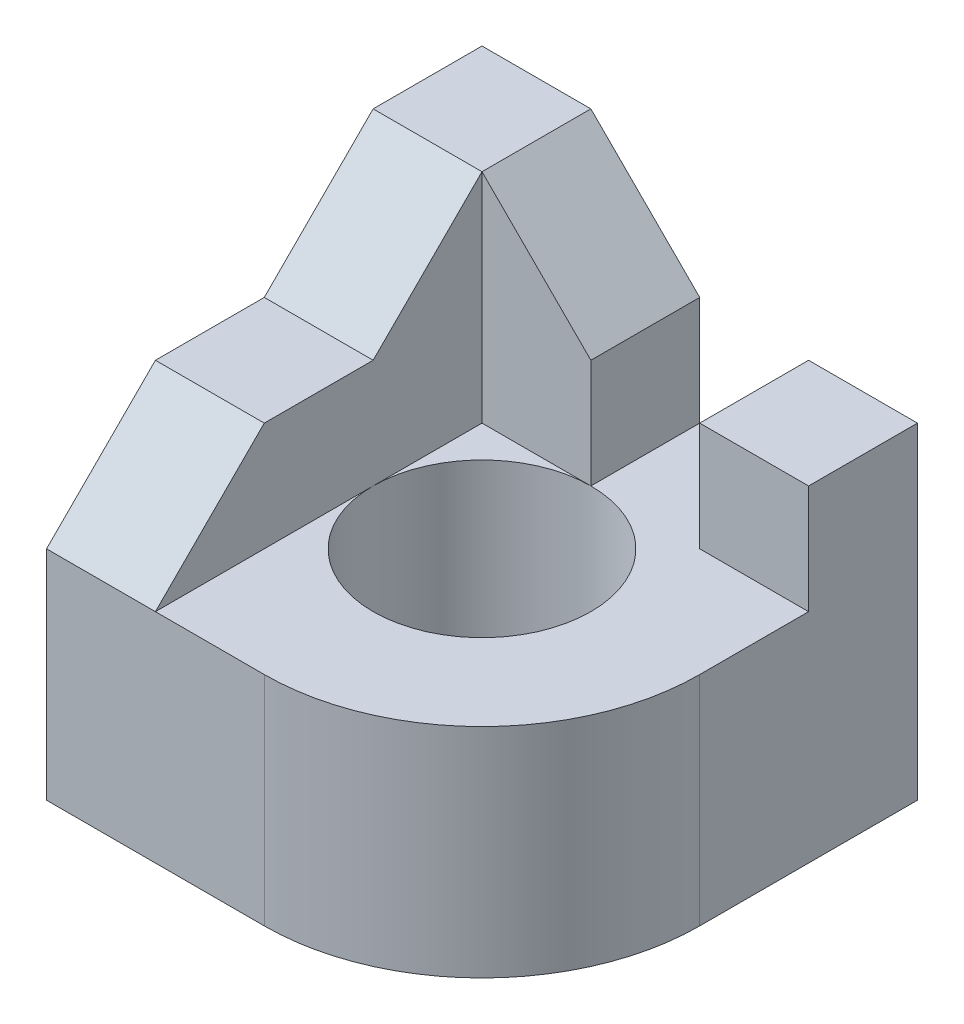
ISO-10303-21;
HEADER;
FILE_DESCRIPTION(('STEP AP214'),'2;1');
FILE_NAME('part.step','',(''),(''),'','','');
FILE_SCHEMA(('AUTOMOTIVE_DESIGN { 1 0 10303 214 1 1 1 1 }'));
ENDSEC;
DATA;
#1=APPLICATION_CONTEXT('core data for automotive mechanical design processes');
#2=APPLICATION_PROTOCOL_DEFINITION('international standard','automotive_design',2000,#1);
#3=PRODUCT_CONTEXT('',#1,'mechanical');
#4=PRODUCT('Part','Part','',(#3));
#5=PRODUCT_RELATED_PRODUCT_CATEGORY('part','',(#4));
#6=PRODUCT_DEFINITION_FORMATION('','',#4);
#7=PRODUCT_DEFINITION_CONTEXT('part definition',#1,'design');
#8=PRODUCT_DEFINITION('design','',#6,#7);
#9=PRODUCT_DEFINITION_SHAPE('','',#8);
#10=(LENGTH_UNIT() NAMED_UNIT(*) SI_UNIT(.MILLI.,.METRE.));
#11=(NAMED_UNIT(*) PLANE_ANGLE_UNIT() SI_UNIT($,.RADIAN.));
#12=(NAMED_UNIT(*) SI_UNIT($,.STERADIAN.) SOLID_ANGLE_UNIT());
#13=UNCERTAINTY_MEASURE_WITH_UNIT(LENGTH_MEASURE(1.E-05),#10,'distance_accuracy_value','');
#14=(GEOMETRIC_REPRESENTATION_CONTEXT(3) GLOBAL_UNCERTAINTY_ASSIGNED_CONTEXT((#13)) GLOBAL_UNIT_ASSIGNED_CONTEXT((#10,
#11,#12)) REPRESENTATION_CONTEXT('',''));
#15=CARTESIAN_POINT('',(0.,0.,0.));
#16=DIRECTION('',(0.,0.,1.));
#17=DIRECTION('',(1.,0.,0.));
#18=AXIS2_PLACEMENT_3D('',#15,#16,#17);
#19=CARTESIAN_POINT('',(0.,0.,0.));
#20=DIRECTION('',(0.,1.,0.));
#21=DIRECTION('',(0.,0.,1.));
#22=AXIS2_PLACEMENT_3D('',#19,#20,#21);
#23=CYLINDRICAL_SURFACE('',#22,10.);
#24=CARTESIAN_POINT('',(0.,0.,0.));
#25=DIRECTION('',(0.,1.,0.));
#26=DIRECTION('',(0.,0.,1.));
#27=AXIS2_PLACEMENT_3D('',#24,#25,#26);
#28=CIRCLE('',#27,10.);
#29=CARTESIAN_POINT('',(0.,0.,10.));
#30=VERTEX_POINT('',#29);
#31=EDGE_CURVE('E217',#30,#30,#28,.T.);
#32=ORIENTED_EDGE('',*,*,#31,.F.);
#33=EDGE_LOOP('',(#32));
#34=FACE_BOUND('',#33,.T.);
#35=CARTESIAN_POINT('',(0.,20.,0.));
#36=DIRECTION('',(0.,1.,0.));
#37=DIRECTION('',(0.,0.,1.));
#38=AXIS2_PLACEMENT_3D('',#35,#36,#37);
#39=CIRCLE('',#38,10.);
#40=CARTESIAN_POINT('',(0.,20.,-10.));
#41=VERTEX_POINT('',#40);
#42=CARTESIAN_POINT('',(-10.,20.,0.));
#43=VERTEX_POINT('',#42);
#44=EDGE_CURVE('E311',#41,#43,#39,.T.);
#45=ORIENTED_EDGE('',*,*,#44,.T.);
#46=CARTESIAN_POINT('',(0.,20.,0.));
#47=DIRECTION('',(0.,-1.,0.));
#48=DIRECTION('',(0.,0.,-1.));
#49=AXIS2_PLACEMENT_3D('',#46,#47,#48);
#50=CIRCLE('',#49,10.);
#51=EDGE_CURVE('E210',#43,#41,#50,.F.);
#52=ORIENTED_EDGE('',*,*,#51,.T.);
#53=EDGE_LOOP('',(#45,#52));
#54=FACE_BOUND('',#53,.T.);
#55=ADVANCED_FACE('F44',(#34,#54),#23,.F.);
#56=CARTESIAN_POINT('',(0.,30.,-20.));
#57=DIRECTION('',(-0.707106781186548,-0.707106781186547,0.));
#58=DIRECTION('',(0.707106781186547,-0.707106781186548,0.));
#59=AXIS2_PLACEMENT_3D('',#56,#57,#58);
#60=PLANE('',#59);
#61=DIRECTION('',(-0.707106781186547,0.707106781186548,0.));
#62=VECTOR('',#61,1.);
#63=CARTESIAN_POINT('',(0.,30.,-10.));
#64=LINE('',#63,#62);
#65=CARTESIAN_POINT('',(0.,30.,-10.));
#66=VERTEX_POINT('',#65);
#67=CARTESIAN_POINT('',(-10.,40.,-10.));
#68=VERTEX_POINT('',#67);
#69=EDGE_CURVE('E152',#66,#68,#64,.T.);
#70=ORIENTED_EDGE('',*,*,#69,.F.);
#71=DIRECTION('',(0.,0.,1.));
#72=VECTOR('',#71,1.);
#73=CARTESIAN_POINT('',(0.,30.,-20.));
#74=LINE('',#73,#72);
#75=CARTESIAN_POINT('',(0.,30.,-20.));
#76=VERTEX_POINT('',#75);
#77=EDGE_CURVE('E190',#76,#66,#74,.T.);
#78=ORIENTED_EDGE('',*,*,#77,.F.);
#79=DIRECTION('',(0.707106781186547,-0.707106781186548,0.));
#80=VECTOR('',#79,1.);
#81=CARTESIAN_POINT('',(0.,30.,-20.));
#82=LINE('',#81,#80);
#83=CARTESIAN_POINT('',(-10.,40.,-20.));
#84=VERTEX_POINT('',#83);
#85=EDGE_CURVE('E186',#84,#76,#82,.T.);
#86=ORIENTED_EDGE('',*,*,#85,.F.);
#87=DIRECTION('',(0.,0.,1.));
#88=VECTOR('',#87,1.);
#89=CARTESIAN_POINT('',(-10.,40.,-20.));
#90=LINE('',#89,#88);
#91=EDGE_CURVE('E182',#84,#68,#90,.T.);
#92=ORIENTED_EDGE('',*,*,#91,.T.);
#93=EDGE_LOOP('',(#70,#78,#86,#92));
#94=FACE_BOUND('',#93,.T.);
#95=ADVANCED_FACE('F188',(#94),#60,.F.);
#96=CARTESIAN_POINT('',(-20.,40.,20.));
#97=DIRECTION('',(0.,0.,-1.));
#98=DIRECTION('',(-1.,0.,0.));
#99=AXIS2_PLACEMENT_3D('',#96,#97,#98);
#100=PLANE('',#99);
#101=DIRECTION('',(0.,1.,0.));
#102=VECTOR('',#101,1.);
#103=CARTESIAN_POINT('',(0.,0.,20.));
#104=LINE('',#103,#102);
#105=CARTESIAN_POINT('',(0.,0.,20.));
#106=VERTEX_POINT('',#105);
#107=CARTESIAN_POINT('',(0.,20.,20.));
#108=VERTEX_POINT('',#107);
#109=EDGE_CURVE('E67',#106,#108,#104,.T.);
#110=ORIENTED_EDGE('',*,*,#109,.T.);
#111=DIRECTION('',(1.,0.,0.));
#112=VECTOR('',#111,1.);
#113=CARTESIAN_POINT('',(0.,20.,20.));
#114=LINE('',#113,#112);
#115=CARTESIAN_POINT('',(-10.,20.,20.));
#116=VERTEX_POINT('',#115);
#117=EDGE_CURVE('E162',#116,#108,#114,.T.);
#118=ORIENTED_EDGE('',*,*,#117,.F.);
#119=DIRECTION('',(1.,0.,0.));
#120=VECTOR('',#119,1.);
#121=CARTESIAN_POINT('',(-20.,20.,20.));
#122=LINE('',#121,#120);
#123=CARTESIAN_POINT('',(-20.,20.,20.));
#124=VERTEX_POINT('',#123);
#125=EDGE_CURVE('E258',#124,#116,#122,.T.);
#126=ORIENTED_EDGE('',*,*,#125,.F.);
#127=DIRECTION('',(0.,-1.,0.));
#128=VECTOR('',#127,1.);
#129=CARTESIAN_POINT('',(-20.,40.,20.));
#130=LINE('',#129,#128);
#131=CARTESIAN_POINT('',(-20.,0.,20.));
#132=VERTEX_POINT('',#131);
#133=EDGE_CURVE('E227',#124,#132,#130,.T.);
#134=ORIENTED_EDGE('',*,*,#133,.T.);
#135=DIRECTION('',(1.,0.,0.));
#136=VECTOR('',#135,1.);
#137=CARTESIAN_POINT('',(-20.,0.,20.));
#138=LINE('',#137,#136);
#139=EDGE_CURVE('E225',#132,#106,#138,.T.);
#140=ORIENTED_EDGE('',*,*,#139,.T.);
#141=EDGE_LOOP('',(#110,#118,#126,#134,#140));
#142=FACE_BOUND('',#141,.T.);
#143=ADVANCED_FACE('F329',(#142),#100,.F.);
#144=CARTESIAN_POINT('',(0.,40.,0.));
#145=DIRECTION('',(0.,-1.,0.));
#146=DIRECTION('',(0.,0.,-1.));
#147=AXIS2_PLACEMENT_3D('',#144,#145,#146);
#148=PLANE('',#147);
#149=DIRECTION('',(0.,0.,1.));
#150=VECTOR('',#149,1.);
#151=CARTESIAN_POINT('',(-20.,40.,20.));
#152=LINE('',#151,#150);
#153=CARTESIAN_POINT('',(-20.,40.,-20.));
#154=VERTEX_POINT('',#153);
#155=CARTESIAN_POINT('',(-20.,40.,-10.));
#156=VERTEX_POINT('',#155);
#157=EDGE_CURVE('E185',#154,#156,#152,.T.);
#158=ORIENTED_EDGE('',*,*,#157,.T.);
#159=DIRECTION('',(1.,0.,0.));
#160=VECTOR('',#159,1.);
#161=CARTESIAN_POINT('',(-20.,40.,-10.));
#162=LINE('',#161,#160);
#163=EDGE_CURVE('E175',#156,#68,#162,.T.);
#164=ORIENTED_EDGE('',*,*,#163,.T.);
#165=ORIENTED_EDGE('',*,*,#91,.F.);
#166=DIRECTION('',(-1.,0.,0.));
#167=VECTOR('',#166,1.);
#168=CARTESIAN_POINT('',(-20.,40.,-20.));
#169=LINE('',#168,#167);
#170=EDGE_CURVE('E223',#84,#154,#169,.T.);
#171=ORIENTED_EDGE('',*,*,#170,.T.);
#172=EDGE_LOOP('',(#158,#164,#165,#171));
#173=FACE_BOUND('',#172,.T.);
#174=ADVANCED_FACE('F181',(#173),#148,.F.);
#175=CARTESIAN_POINT('',(0.,0.,0.));
#176=DIRECTION('',(0.,-1.,0.));
#177=DIRECTION('',(0.,0.,-1.));
#178=AXIS2_PLACEMENT_3D('',#175,#176,#177);
#179=PLANE('',#178);
#180=ORIENTED_EDGE('',*,*,#31,.T.);
#181=EDGE_LOOP('',(#180));
#182=FACE_BOUND('',#181,.T.);
#183=CARTESIAN_POINT('',(0.,0.,0.));
#184=DIRECTION('',(0.,1.,0.));
#185=DIRECTION('',(0.,0.,1.));
#186=AXIS2_PLACEMENT_3D('',#183,#184,#185);
#187=CIRCLE('',#186,20.);
#188=CARTESIAN_POINT('',(20.,0.,0.));
#189=VERTEX_POINT('',#188);
#190=EDGE_CURVE('E213',#189,#106,#187,.F.);
#191=ORIENTED_EDGE('',*,*,#190,.T.);
#192=ORIENTED_EDGE('',*,*,#139,.F.);
#193=DIRECTION('',(0.,0.,1.));
#194=VECTOR('',#193,1.);
#195=CARTESIAN_POINT('',(-20.,0.,20.));
#196=LINE('',#195,#194);
#197=CARTESIAN_POINT('',(-20.,0.,-20.));
#198=VERTEX_POINT('',#197);
#199=EDGE_CURVE('E232',#198,#132,#196,.T.);
#200=ORIENTED_EDGE('',*,*,#199,.F.);
#201=DIRECTION('',(-1.,0.,0.));
#202=VECTOR('',#201,1.);
#203=CARTESIAN_POINT('',(-20.,0.,-20.));
#204=LINE('',#203,#202);
#205=CARTESIAN_POINT('',(20.,0.,-20.));
#206=VERTEX_POINT('',#205);
#207=EDGE_CURVE('E230',#206,#198,#204,.T.);
#208=ORIENTED_EDGE('',*,*,#207,.F.);
#209=DIRECTION('',(0.,0.,-1.));
#210=VECTOR('',#209,1.);
#211=CARTESIAN_POINT('',(20.,0.,20.));
#212=LINE('',#211,#210);
#213=EDGE_CURVE('E222',#189,#206,#212,.T.);
#214=ORIENTED_EDGE('',*,*,#213,.F.);
#215=EDGE_LOOP('',(#191,#192,#200,#208,#214));
#216=FACE_BOUND('',#215,.T.);
#217=ADVANCED_FACE('F338',(#182,#216),#179,.T.);
#218=CARTESIAN_POINT('',(20.,40.,20.));
#219=DIRECTION('',(-1.,0.,0.));
#220=DIRECTION('',(0.,0.,1.));
#221=AXIS2_PLACEMENT_3D('',#218,#219,#220);
#222=PLANE('',#221);
#223=DIRECTION('',(0.,-1.,0.));
#224=VECTOR('',#223,1.);
#225=CARTESIAN_POINT('',(20.,40.,-20.));
#226=LINE('',#225,#224);
#227=CARTESIAN_POINT('',(20.,30.,-20.));
#228=VERTEX_POINT('',#227);
#229=EDGE_CURVE('E241',#228,#206,#226,.T.);
#230=ORIENTED_EDGE('',*,*,#229,.F.);
#231=DIRECTION('',(0.,0.,1.));
#232=VECTOR('',#231,1.);
#233=CARTESIAN_POINT('',(20.,30.,-20.));
#234=LINE('',#233,#232);
#235=CARTESIAN_POINT('',(20.,30.,-10.));
#236=VERTEX_POINT('',#235);
#237=EDGE_CURVE('E206',#228,#236,#234,.T.);
#238=ORIENTED_EDGE('',*,*,#237,.T.);
#239=DIRECTION('',(0.,1.,0.));
#240=VECTOR('',#239,1.);
#241=CARTESIAN_POINT('',(20.,40.,-10.));
#242=LINE('',#241,#240);
#243=CARTESIAN_POINT('',(20.,20.,-10.));
#244=VERTEX_POINT('',#243);
#245=EDGE_CURVE('E202',#244,#236,#242,.T.);
#246=ORIENTED_EDGE('',*,*,#245,.F.);
#247=DIRECTION('',(0.,0.,-1.));
#248=VECTOR('',#247,1.);
#249=CARTESIAN_POINT('',(20.,20.,-10.));
#250=LINE('',#249,#248);
#251=CARTESIAN_POINT('',(20.,20.,0.));
#252=VERTEX_POINT('',#251);
#253=EDGE_CURVE('E203',#252,#244,#250,.T.);
#254=ORIENTED_EDGE('',*,*,#253,.F.);
#255=DIRECTION('',(0.,1.,0.));
#256=VECTOR('',#255,1.);
#257=CARTESIAN_POINT('',(20.,0.,0.));
#258=LINE('',#257,#256);
#259=EDGE_CURVE('E215',#189,#252,#258,.T.);
#260=ORIENTED_EDGE('',*,*,#259,.F.);
#261=ORIENTED_EDGE('',*,*,#213,.T.);
#262=EDGE_LOOP('',(#230,#238,#246,#254,#260,#261));
#263=FACE_BOUND('',#262,.T.);
#264=ADVANCED_FACE('F46',(#263),#222,.F.);
#265=CARTESIAN_POINT('',(-20.,40.,-20.));
#266=DIRECTION('',(0.,0.,1.));
#267=DIRECTION('',(1.,0.,0.));
#268=AXIS2_PLACEMENT_3D('',#265,#266,#267);
#269=PLANE('',#268);
#270=DIRECTION('',(0.,1.,0.));
#271=VECTOR('',#270,1.);
#272=CARTESIAN_POINT('',(10.,30.,-20.));
#273=LINE('',#272,#271);
#274=CARTESIAN_POINT('',(10.,20.,-20.));
#275=VERTEX_POINT('',#274);
#276=CARTESIAN_POINT('',(10.,30.,-20.));
#277=VERTEX_POINT('',#276);
#278=EDGE_CURVE('E196',#275,#277,#273,.T.);
#279=ORIENTED_EDGE('',*,*,#278,.T.);
#280=DIRECTION('',(1.,0.,0.));
#281=VECTOR('',#280,1.);
#282=CARTESIAN_POINT('',(20.,30.,-20.));
#283=LINE('',#282,#281);
#284=EDGE_CURVE('E191',#277,#228,#283,.T.);
#285=ORIENTED_EDGE('',*,*,#284,.T.);
#286=ORIENTED_EDGE('',*,*,#229,.T.);
#287=ORIENTED_EDGE('',*,*,#207,.T.);
#288=DIRECTION('',(0.,-1.,0.));
#289=VECTOR('',#288,1.);
#290=CARTESIAN_POINT('',(-20.,40.,-20.));
#291=LINE('',#290,#289);
#292=EDGE_CURVE('E238',#154,#198,#291,.T.);
#293=ORIENTED_EDGE('',*,*,#292,.F.);
#294=ORIENTED_EDGE('',*,*,#170,.F.);
#295=ORIENTED_EDGE('',*,*,#85,.T.);
#296=DIRECTION('',(0.,-1.,0.));
#297=VECTOR('',#296,1.);
#298=CARTESIAN_POINT('',(0.,20.,-20.));
#299=LINE('',#298,#297);
#300=CARTESIAN_POINT('',(0.,20.,-20.));
#301=VERTEX_POINT('',#300);
#302=EDGE_CURVE('E272',#76,#301,#299,.T.);
#303=ORIENTED_EDGE('',*,*,#302,.T.);
#304=DIRECTION('',(1.,0.,0.));
#305=VECTOR('',#304,1.);
#306=CARTESIAN_POINT('',(10.,20.,-20.));
#307=LINE('',#306,#305);
#308=EDGE_CURVE('E275',#301,#275,#307,.T.);
#309=ORIENTED_EDGE('',*,*,#308,.T.);
#310=EDGE_LOOP('',(#279,#285,#286,#287,#293,#294,#295,#303,#309));
#311=FACE_BOUND('',#310,.T.);
#312=ADVANCED_FACE('F294',(#311),#269,.F.);
#313=CARTESIAN_POINT('',(-20.,40.,20.));
#314=DIRECTION('',(1.,0.,0.));
#315=DIRECTION('',(0.,0.,-1.));
#316=AXIS2_PLACEMENT_3D('',#313,#314,#315);
#317=PLANE('',#316);
#318=DIRECTION('',(0.,0.,-1.));
#319=VECTOR('',#318,1.);
#320=CARTESIAN_POINT('',(-20.,30.,0.));
#321=LINE('',#320,#319);
#322=CARTESIAN_POINT('',(-20.,30.,10.));
#323=VERTEX_POINT('',#322);
#324=CARTESIAN_POINT('',(-20.,30.,0.));
#325=VERTEX_POINT('',#324);
#326=EDGE_CURVE('E264',#323,#325,#321,.T.);
#327=ORIENTED_EDGE('',*,*,#326,.T.);
#328=DIRECTION('',(0.,0.707106781186548,-0.707106781186547));
#329=VECTOR('',#328,1.);
#330=CARTESIAN_POINT('',(-20.,40.,-10.));
#331=LINE('',#330,#329);
#332=EDGE_CURVE('E268',#325,#156,#331,.T.);
#333=ORIENTED_EDGE('',*,*,#332,.T.);
#334=ORIENTED_EDGE('',*,*,#157,.F.);
#335=ORIENTED_EDGE('',*,*,#292,.T.);
#336=ORIENTED_EDGE('',*,*,#199,.T.);
#337=ORIENTED_EDGE('',*,*,#133,.F.);
#338=DIRECTION('',(0.,0.707106781186547,-0.707106781186548));
#339=VECTOR('',#338,1.);
#340=CARTESIAN_POINT('',(-20.,30.,10.));
#341=LINE('',#340,#339);
#342=EDGE_CURVE('E301',#124,#323,#341,.T.);
#343=ORIENTED_EDGE('',*,*,#342,.T.);
#344=EDGE_LOOP('',(#327,#333,#334,#335,#336,#337,#343));
#345=FACE_BOUND('',#344,.T.);
#346=ADVANCED_FACE('F299',(#345),#317,.F.);
#347=CARTESIAN_POINT('',(0.,0.,0.));
#348=DIRECTION('',(0.,1.,0.));
#349=DIRECTION('',(0.,0.,1.));
#350=AXIS2_PLACEMENT_3D('',#347,#348,#349);
#351=CYLINDRICAL_SURFACE('',#350,20.);
#352=ORIENTED_EDGE('',*,*,#259,.T.);
#353=CARTESIAN_POINT('',(0.,20.,0.));
#354=DIRECTION('',(0.,-1.,0.));
#355=DIRECTION('',(0.,0.,-1.));
#356=AXIS2_PLACEMENT_3D('',#353,#354,#355);
#357=CIRCLE('',#356,20.);
#358=EDGE_CURVE('E243',#252,#108,#357,.T.);
#359=ORIENTED_EDGE('',*,*,#358,.T.);
#360=ORIENTED_EDGE('',*,*,#109,.F.);
#361=ORIENTED_EDGE('',*,*,#190,.F.);
#362=EDGE_LOOP('',(#352,#359,#360,#361));
#363=FACE_BOUND('',#362,.T.);
#364=ADVANCED_FACE('F334',(#363),#351,.T.);
#365=CARTESIAN_POINT('',(0.,20.,-10.));
#366=DIRECTION('',(0.,-1.,0.));
#367=DIRECTION('',(0.,0.,-1.));
#368=AXIS2_PLACEMENT_3D('',#365,#366,#367);
#369=PLANE('',#368);
#370=DIRECTION('',(1.,0.,0.));
#371=VECTOR('',#370,1.);
#372=CARTESIAN_POINT('',(0.,20.,-10.));
#373=LINE('',#372,#371);
#374=CARTESIAN_POINT('',(10.,20.,-10.));
#375=VERTEX_POINT('',#374);
#376=EDGE_CURVE('E201',#375,#244,#373,.T.);
#377=ORIENTED_EDGE('',*,*,#376,.F.);
#378=DIRECTION('',(0.,0.,1.));
#379=VECTOR('',#378,1.);
#380=CARTESIAN_POINT('',(10.,20.,-20.));
#381=LINE('',#380,#379);
#382=EDGE_CURVE('E285',#275,#375,#381,.T.);
#383=ORIENTED_EDGE('',*,*,#382,.F.);
#384=ORIENTED_EDGE('',*,*,#308,.F.);
#385=DIRECTION('',(0.,0.,1.));
#386=VECTOR('',#385,1.);
#387=CARTESIAN_POINT('',(0.,20.,-20.));
#388=LINE('',#387,#386);
#389=EDGE_CURVE('E193',#301,#41,#388,.T.);
#390=ORIENTED_EDGE('',*,*,#389,.T.);
#391=ORIENTED_EDGE('',*,*,#51,.F.);
#392=DIRECTION('',(0.,0.,1.));
#393=VECTOR('',#392,1.);
#394=CARTESIAN_POINT('',(-10.,20.,0.));
#395=LINE('',#394,#393);
#396=EDGE_CURVE('E59',#43,#116,#395,.T.);
#397=ORIENTED_EDGE('',*,*,#396,.T.);
#398=ORIENTED_EDGE('',*,*,#117,.T.);
#399=ORIENTED_EDGE('',*,*,#358,.F.);
#400=ORIENTED_EDGE('',*,*,#253,.T.);
#401=EDGE_LOOP('',(#377,#383,#384,#390,#391,#397,#398,#399,#400));
#402=FACE_BOUND('',#401,.T.);
#403=ADVANCED_FACE('F289',(#402),#369,.F.);
#404=CARTESIAN_POINT('',(0.,40.,-10.));
#405=DIRECTION('',(0.,0.,-1.));
#406=DIRECTION('',(0.,1.,0.));
#407=AXIS2_PLACEMENT_3D('',#404,#405,#406);
#408=PLANE('',#407);
#409=ORIENTED_EDGE('',*,*,#245,.T.);
#410=DIRECTION('',(-1.,0.,0.));
#411=VECTOR('',#410,1.);
#412=CARTESIAN_POINT('',(0.,30.,-10.));
#413=LINE('',#412,#411);
#414=CARTESIAN_POINT('',(10.,30.,-10.));
#415=VERTEX_POINT('',#414);
#416=EDGE_CURVE('E248',#236,#415,#413,.T.);
#417=ORIENTED_EDGE('',*,*,#416,.T.);
#418=DIRECTION('',(0.,-1.,0.));
#419=VECTOR('',#418,1.);
#420=CARTESIAN_POINT('',(10.,40.,-10.));
#421=LINE('',#420,#419);
#422=EDGE_CURVE('E245',#415,#375,#421,.T.);
#423=ORIENTED_EDGE('',*,*,#422,.T.);
#424=ORIENTED_EDGE('',*,*,#376,.T.);
#425=EDGE_LOOP('',(#409,#417,#423,#424));
#426=FACE_BOUND('',#425,.T.);
#427=ADVANCED_FACE('F362',(#426),#408,.F.);
#428=CARTESIAN_POINT('',(0.,20.,-20.));
#429=DIRECTION('',(-1.,0.,0.));
#430=DIRECTION('',(0.,0.,1.));
#431=AXIS2_PLACEMENT_3D('',#428,#429,#430);
#432=PLANE('',#431);
#433=ORIENTED_EDGE('',*,*,#389,.F.);
#434=ORIENTED_EDGE('',*,*,#302,.F.);
#435=ORIENTED_EDGE('',*,*,#77,.T.);
#436=DIRECTION('',(0.,1.,0.));
#437=VECTOR('',#436,1.);
#438=CARTESIAN_POINT('',(0.,40.,-10.));
#439=LINE('',#438,#437);
#440=EDGE_CURVE('E158',#41,#66,#439,.T.);
#441=ORIENTED_EDGE('',*,*,#440,.F.);
#442=EDGE_LOOP('',(#433,#434,#435,#441));
#443=FACE_BOUND('',#442,.T.);
#444=ADVANCED_FACE('F292',(#443),#432,.F.);
#445=CARTESIAN_POINT('',(10.,30.,-20.));
#446=DIRECTION('',(1.,0.,0.));
#447=DIRECTION('',(0.,1.,0.));
#448=AXIS2_PLACEMENT_3D('',#445,#446,#447);
#449=PLANE('',#448);
#450=DIRECTION('',(0.,0.,1.));
#451=VECTOR('',#450,1.);
#452=CARTESIAN_POINT('',(10.,30.,-20.));
#453=LINE('',#452,#451);
#454=EDGE_CURVE('E282',#277,#415,#453,.T.);
#455=ORIENTED_EDGE('',*,*,#454,.F.);
#456=ORIENTED_EDGE('',*,*,#278,.F.);
#457=ORIENTED_EDGE('',*,*,#382,.T.);
#458=ORIENTED_EDGE('',*,*,#422,.F.);
#459=EDGE_LOOP('',(#455,#456,#457,#458));
#460=FACE_BOUND('',#459,.T.);
#461=ADVANCED_FACE('F378',(#460),#449,.F.);
#462=CARTESIAN_POINT('',(20.,30.,-20.));
#463=DIRECTION('',(0.,-1.,0.));
#464=DIRECTION('',(0.,0.,-1.));
#465=AXIS2_PLACEMENT_3D('',#462,#463,#464);
#466=PLANE('',#465);
#467=ORIENTED_EDGE('',*,*,#237,.F.);
#468=ORIENTED_EDGE('',*,*,#284,.F.);
#469=ORIENTED_EDGE('',*,*,#454,.T.);
#470=ORIENTED_EDGE('',*,*,#416,.F.);
#471=EDGE_LOOP('',(#467,#468,#469,#470));
#472=FACE_BOUND('',#471,.T.);
#473=ADVANCED_FACE('F360',(#472),#466,.F.);
#474=CARTESIAN_POINT('',(-20.,40.,-10.));
#475=DIRECTION('',(0.,-0.707106781186547,-0.707106781186548));
#476=DIRECTION('',(0.,0.707106781186548,-0.707106781186547));
#477=AXIS2_PLACEMENT_3D('',#474,#475,#476);
#478=PLANE('',#477);
#479=DIRECTION('',(1.,0.,0.));
#480=VECTOR('',#479,1.);
#481=CARTESIAN_POINT('',(-20.,30.,0.));
#482=LINE('',#481,#480);
#483=CARTESIAN_POINT('',(-10.,30.,0.));
#484=VERTEX_POINT('',#483);
#485=EDGE_CURVE('E177',#325,#484,#482,.T.);
#486=ORIENTED_EDGE('',*,*,#485,.T.);
#487=DIRECTION('',(0.,0.707106781186548,-0.707106781186547));
#488=VECTOR('',#487,1.);
#489=CARTESIAN_POINT('',(-10.,40.,-10.));
#490=LINE('',#489,#488);
#491=EDGE_CURVE('E12',#484,#68,#490,.T.);
#492=ORIENTED_EDGE('',*,*,#491,.T.);
#493=ORIENTED_EDGE('',*,*,#163,.F.);
#494=ORIENTED_EDGE('',*,*,#332,.F.);
#495=EDGE_LOOP('',(#486,#492,#493,#494));
#496=FACE_BOUND('',#495,.T.);
#497=ADVANCED_FACE('F173',(#496),#478,.F.);
#498=CARTESIAN_POINT('',(-20.,30.,0.));
#499=DIRECTION('',(0.,-1.,0.));
#500=DIRECTION('',(0.,0.,-1.));
#501=AXIS2_PLACEMENT_3D('',#498,#499,#500);
#502=PLANE('',#501);
#503=DIRECTION('',(1.,0.,0.));
#504=VECTOR('',#503,1.);
#505=CARTESIAN_POINT('',(-20.,30.,10.));
#506=LINE('',#505,#504);
#507=CARTESIAN_POINT('',(-10.,30.,10.));
#508=VERTEX_POINT('',#507);
#509=EDGE_CURVE('E255',#323,#508,#506,.T.);
#510=ORIENTED_EDGE('',*,*,#509,.T.);
#511=DIRECTION('',(0.,0.,1.));
#512=VECTOR('',#511,1.);
#513=CARTESIAN_POINT('',(-10.,30.,0.));
#514=LINE('',#513,#512);
#515=EDGE_CURVE('E262',#484,#508,#514,.T.);
#516=ORIENTED_EDGE('',*,*,#515,.F.);
#517=ORIENTED_EDGE('',*,*,#485,.F.);
#518=ORIENTED_EDGE('',*,*,#326,.F.);
#519=EDGE_LOOP('',(#510,#516,#517,#518));
#520=FACE_BOUND('',#519,.T.);
#521=ADVANCED_FACE('F261',(#520),#502,.F.);
#522=CARTESIAN_POINT('',(-20.,30.,10.));
#523=DIRECTION('',(0.,-0.707106781186548,-0.707106781186547));
#524=DIRECTION('',(0.,0.707106781186547,-0.707106781186548));
#525=AXIS2_PLACEMENT_3D('',#522,#523,#524);
#526=PLANE('',#525);
#527=ORIENTED_EDGE('',*,*,#125,.T.);
#528=DIRECTION('',(0.,0.707106781186547,-0.707106781186548));
#529=VECTOR('',#528,1.);
#530=CARTESIAN_POINT('',(-10.,30.,10.));
#531=LINE('',#530,#529);
#532=EDGE_CURVE('E52',#116,#508,#531,.T.);
#533=ORIENTED_EDGE('',*,*,#532,.T.);
#534=ORIENTED_EDGE('',*,*,#509,.F.);
#535=ORIENTED_EDGE('',*,*,#342,.F.);
#536=EDGE_LOOP('',(#527,#533,#534,#535));
#537=FACE_BOUND('',#536,.T.);
#538=ADVANCED_FACE('F254',(#537),#526,.F.);
#539=CARTESIAN_POINT('',(-10.,30.,0.));
#540=DIRECTION('',(-1.,0.,0.));
#541=DIRECTION('',(0.,0.,1.));
#542=AXIS2_PLACEMENT_3D('',#539,#540,#541);
#543=PLANE('',#542);
#544=ORIENTED_EDGE('',*,*,#396,.F.);
#545=DIRECTION('',(0.,0.,-1.));
#546=VECTOR('',#545,1.);
#547=CARTESIAN_POINT('',(-10.,20.,0.));
#548=LINE('',#547,#546);
#549=CARTESIAN_POINT('',(-10.,20.,-10.));
#550=VERTEX_POINT('',#549);
#551=EDGE_CURVE('E168',#43,#550,#548,.T.);
#552=ORIENTED_EDGE('',*,*,#551,.T.);
#553=DIRECTION('',(0.,-1.,0.));
#554=VECTOR('',#553,1.);
#555=CARTESIAN_POINT('',(-10.,40.,-10.));
#556=LINE('',#555,#554);
#557=EDGE_CURVE('E155',#68,#550,#556,.T.);
#558=ORIENTED_EDGE('',*,*,#557,.F.);
#559=ORIENTED_EDGE('',*,*,#491,.F.);
#560=ORIENTED_EDGE('',*,*,#515,.T.);
#561=ORIENTED_EDGE('',*,*,#532,.F.);
#562=EDGE_LOOP('',(#544,#552,#558,#559,#560,#561));
#563=FACE_BOUND('',#562,.T.);
#564=ADVANCED_FACE('F166',(#563),#543,.F.);
#565=CARTESIAN_POINT('',(0.,40.,-10.));
#566=DIRECTION('',(0.,0.,1.));
#567=DIRECTION('',(0.,-1.,0.));
#568=AXIS2_PLACEMENT_3D('',#565,#566,#567);
#569=PLANE('',#568);
#570=ORIENTED_EDGE('',*,*,#69,.T.);
#571=ORIENTED_EDGE('',*,*,#557,.T.);
#572=DIRECTION('',(-1.,0.,0.));
#573=VECTOR('',#572,1.);
#574=CARTESIAN_POINT('',(0.,20.,-10.));
#575=LINE('',#574,#573);
#576=EDGE_CURVE('E309',#41,#550,#575,.T.);
#577=ORIENTED_EDGE('',*,*,#576,.F.);
#578=ORIENTED_EDGE('',*,*,#440,.T.);
#579=EDGE_LOOP('',(#570,#571,#577,#578));
#580=FACE_BOUND('',#579,.T.);
#581=ADVANCED_FACE('F154',(#580),#569,.T.);
#582=CARTESIAN_POINT('',(0.,20.,0.));
#583=DIRECTION('',(0.,1.,0.));
#584=DIRECTION('',(0.,0.,1.));
#585=AXIS2_PLACEMENT_3D('',#582,#583,#584);
#586=PLANE('',#585);
#587=ORIENTED_EDGE('',*,*,#44,.F.);
#588=ORIENTED_EDGE('',*,*,#576,.T.);
#589=ORIENTED_EDGE('',*,*,#551,.F.);
#590=EDGE_LOOP('',(#587,#588,#589));
#591=FACE_BOUND('',#590,.T.);
#592=ADVANCED_FACE('F316',(#591),#586,.T.);
#593=CLOSED_SHELL('',(#55,#95,#143,#174,#217,#264,#312,#346,#364,#403,#427,#444,#461,#473,#497,
#521,#538,#564,#581,#592));
#594=MANIFOLD_SOLID_BREP('B2',#593);
#595=ADVANCED_BREP_SHAPE_REPRESENTATION('',(#18,#594),#14);
#596=SHAPE_DEFINITION_REPRESENTATION(#9,#595);
ENDSEC;
END-ISO-10303-21;
